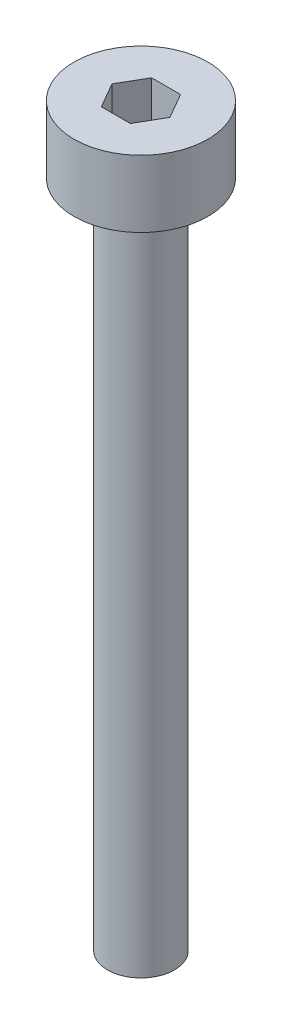
ISO-10303-21;
HEADER;
FILE_DESCRIPTION(('STEP AP214'),'2;1');
FILE_NAME('part.step','',(''),(''),'','','');
FILE_SCHEMA(('AUTOMOTIVE_DESIGN { 1 0 10303 214 1 1 1 1 }'));
ENDSEC;
DATA;
#1=APPLICATION_CONTEXT('core data for automotive mechanical design processes');
#2=APPLICATION_PROTOCOL_DEFINITION('international standard','automotive_design',2000,#1);
#3=PRODUCT_CONTEXT('',#1,'mechanical');
#4=PRODUCT('Part','Part','',(#3));
#5=PRODUCT_RELATED_PRODUCT_CATEGORY('part','',(#4));
#6=PRODUCT_DEFINITION_FORMATION('','',#4);
#7=PRODUCT_DEFINITION_CONTEXT('part definition',#1,'design');
#8=PRODUCT_DEFINITION('design','',#6,#7);
#9=PRODUCT_DEFINITION_SHAPE('','',#8);
#10=(LENGTH_UNIT() NAMED_UNIT(*) SI_UNIT(.MILLI.,.METRE.));
#11=(NAMED_UNIT(*) PLANE_ANGLE_UNIT() SI_UNIT($,.RADIAN.));
#12=(NAMED_UNIT(*) SI_UNIT($,.STERADIAN.) SOLID_ANGLE_UNIT());
#13=UNCERTAINTY_MEASURE_WITH_UNIT(LENGTH_MEASURE(1.E-05),#10,'distance_accuracy_value','');
#14=(GEOMETRIC_REPRESENTATION_CONTEXT(3) GLOBAL_UNCERTAINTY_ASSIGNED_CONTEXT((#13)) GLOBAL_UNIT_ASSIGNED_CONTEXT((#10,
#11,#12)) REPRESENTATION_CONTEXT('',''));
#15=CARTESIAN_POINT('',(0.,0.,0.));
#16=DIRECTION('',(0.,0.,1.));
#17=DIRECTION('',(1.,0.,0.));
#18=AXIS2_PLACEMENT_3D('',#15,#16,#17);
#19=CARTESIAN_POINT('',(0.,2.,0.));
#20=DIRECTION('',(0.,-1.,0.));
#21=DIRECTION('',(0.,0.,-1.));
#22=AXIS2_PLACEMENT_3D('',#19,#20,#21);
#23=CYLINDRICAL_SURFACE('',#22,2.);
#24=CARTESIAN_POINT('',(0.,2.,0.));
#25=DIRECTION('',(0.,1.,0.));
#26=DIRECTION('',(0.,0.,1.));
#27=AXIS2_PLACEMENT_3D('',#24,#25,#26);
#28=CIRCLE('',#27,2.);
#29=CARTESIAN_POINT('',(0.,2.,2.));
#30=VERTEX_POINT('',#29);
#31=EDGE_CURVE('E43',#30,#30,#28,.T.);
#32=ORIENTED_EDGE('',*,*,#31,.F.);
#33=EDGE_LOOP('',(#32));
#34=FACE_BOUND('',#33,.T.);
#35=CARTESIAN_POINT('',(0.,0.,0.));
#36=DIRECTION('',(0.,1.,0.));
#37=DIRECTION('',(0.,0.,1.));
#38=AXIS2_PLACEMENT_3D('',#35,#36,#37);
#39=CIRCLE('',#38,2.);
#40=CARTESIAN_POINT('',(0.,0.,2.));
#41=VERTEX_POINT('',#40);
#42=EDGE_CURVE('E38',#41,#41,#39,.T.);
#43=ORIENTED_EDGE('',*,*,#42,.T.);
#44=EDGE_LOOP('',(#43));
#45=FACE_BOUND('',#44,.T.);
#46=ADVANCED_FACE('F35',(#34,#45),#23,.T.);
#47=CARTESIAN_POINT('',(0.,2.,0.));
#48=DIRECTION('',(0.,1.,0.));
#49=DIRECTION('',(0.,0.,1.));
#50=AXIS2_PLACEMENT_3D('',#47,#48,#49);
#51=PLANE('',#50);
#52=DIRECTION('',(0.5,0.,-0.866025403784439));
#53=VECTOR('',#52,1.);
#54=CARTESIAN_POINT('',(0.433012701892219,2.,0.75));
#55=LINE('',#54,#53);
#56=CARTESIAN_POINT('',(0.433012701892219,2.,0.75));
#57=VERTEX_POINT('',#56);
#58=CARTESIAN_POINT('',(0.866025403784438,2.,0.));
#59=VERTEX_POINT('',#58);
#60=EDGE_CURVE('E51',#57,#59,#55,.T.);
#61=ORIENTED_EDGE('',*,*,#60,.F.);
#62=DIRECTION('',(1.,0.,0.));
#63=VECTOR('',#62,1.);
#64=CARTESIAN_POINT('',(-0.43301270189222,2.,0.75));
#65=LINE('',#64,#63);
#66=CARTESIAN_POINT('',(-0.43301270189222,2.,0.75));
#67=VERTEX_POINT('',#66);
#68=EDGE_CURVE('E135',#67,#57,#65,.T.);
#69=ORIENTED_EDGE('',*,*,#68,.F.);
#70=DIRECTION('',(0.5,0.,0.866025403784439));
#71=VECTOR('',#70,1.);
#72=CARTESIAN_POINT('',(-0.866025403784439,2.,0.));
#73=LINE('',#72,#71);
#74=CARTESIAN_POINT('',(-0.866025403784439,2.,0.));
#75=VERTEX_POINT('',#74);
#76=EDGE_CURVE('E133',#75,#67,#73,.T.);
#77=ORIENTED_EDGE('',*,*,#76,.F.);
#78=DIRECTION('',(-0.5,0.,0.866025403784439));
#79=VECTOR('',#78,1.);
#80=CARTESIAN_POINT('',(-0.43301270189222,2.,-0.750000000000001));
#81=LINE('',#80,#79);
#82=CARTESIAN_POINT('',(-0.43301270189222,2.,-0.750000000000001));
#83=VERTEX_POINT('',#82);
#84=EDGE_CURVE('E99',#83,#75,#81,.T.);
#85=ORIENTED_EDGE('',*,*,#84,.F.);
#86=DIRECTION('',(-1.,0.,0.));
#87=VECTOR('',#86,1.);
#88=CARTESIAN_POINT('',(0.433012701892219,2.,-0.75));
#89=LINE('',#88,#87);
#90=CARTESIAN_POINT('',(0.433012701892219,2.,-0.75));
#91=VERTEX_POINT('',#90);
#92=EDGE_CURVE('E129',#91,#83,#89,.T.);
#93=ORIENTED_EDGE('',*,*,#92,.F.);
#94=DIRECTION('',(-0.5,0.,-0.866025403784439));
#95=VECTOR('',#94,1.);
#96=CARTESIAN_POINT('',(0.866025403784438,2.,0.));
#97=LINE('',#96,#95);
#98=EDGE_CURVE('E125',#59,#91,#97,.T.);
#99=ORIENTED_EDGE('',*,*,#98,.F.);
#100=EDGE_LOOP('',(#61,#69,#77,#85,#93,#99));
#101=FACE_BOUND('',#100,.T.);
#102=ORIENTED_EDGE('',*,*,#31,.T.);
#103=EDGE_LOOP('',(#102));
#104=FACE_BOUND('',#103,.T.);
#105=ADVANCED_FACE('F153',(#101,#104),#51,.T.);
#106=CARTESIAN_POINT('',(0.,0.,0.));
#107=DIRECTION('',(0.,1.,0.));
#108=DIRECTION('',(0.,0.,1.));
#109=AXIS2_PLACEMENT_3D('',#106,#107,#108);
#110=PLANE('',#109);
#111=CARTESIAN_POINT('',(0.,0.,0.));
#112=DIRECTION('',(0.,-1.,0.));
#113=DIRECTION('',(0.,0.,-1.));
#114=AXIS2_PLACEMENT_3D('',#111,#112,#113);
#115=CIRCLE('',#114,1.);
#116=CARTESIAN_POINT('',(0.,0.,-1.));
#117=VERTEX_POINT('',#116);
#118=EDGE_CURVE('E11',#117,#117,#115,.T.);
#119=ORIENTED_EDGE('',*,*,#118,.F.);
#120=EDGE_LOOP('',(#119));
#121=FACE_BOUND('',#120,.T.);
#122=ORIENTED_EDGE('',*,*,#42,.F.);
#123=EDGE_LOOP('',(#122));
#124=FACE_BOUND('',#123,.T.);
#125=ADVANCED_FACE('F150',(#121,#124),#110,.F.);
#126=CARTESIAN_POINT('',(0.433012701892219,0.5,0.75));
#127=DIRECTION('',(0.866025403784439,0.,0.5));
#128=DIRECTION('',(0.5,0.,-0.866025403784439));
#129=AXIS2_PLACEMENT_3D('',#126,#127,#128);
#130=PLANE('',#129);
#131=ORIENTED_EDGE('',*,*,#60,.T.);
#132=DIRECTION('',(0.,1.,0.));
#133=VECTOR('',#132,1.);
#134=CARTESIAN_POINT('',(0.866025403784438,0.5,0.));
#135=LINE('',#134,#133);
#136=CARTESIAN_POINT('',(0.866025403784438,0.5,0.));
#137=VERTEX_POINT('',#136);
#138=EDGE_CURVE('E81',#137,#59,#135,.T.);
#139=ORIENTED_EDGE('',*,*,#138,.F.);
#140=DIRECTION('',(0.5,0.,-0.866025403784439));
#141=VECTOR('',#140,1.);
#142=CARTESIAN_POINT('',(0.433012701892219,0.5,0.75));
#143=LINE('',#142,#141);
#144=CARTESIAN_POINT('',(0.433012701892219,0.5,0.75));
#145=VERTEX_POINT('',#144);
#146=EDGE_CURVE('E137',#145,#137,#143,.T.);
#147=ORIENTED_EDGE('',*,*,#146,.F.);
#148=DIRECTION('',(0.,1.,0.));
#149=VECTOR('',#148,1.);
#150=CARTESIAN_POINT('',(0.433012701892219,0.5,0.75));
#151=LINE('',#150,#149);
#152=EDGE_CURVE('E59',#145,#57,#151,.T.);
#153=ORIENTED_EDGE('',*,*,#152,.T.);
#154=EDGE_LOOP('',(#131,#139,#147,#153));
#155=FACE_BOUND('',#154,.T.);
#156=ADVANCED_FACE('F152',(#155),#130,.F.);
#157=CARTESIAN_POINT('',(-0.43301270189222,0.5,0.75));
#158=DIRECTION('',(0.,0.,1.));
#159=DIRECTION('',(1.,0.,0.));
#160=AXIS2_PLACEMENT_3D('',#157,#158,#159);
#161=PLANE('',#160);
#162=ORIENTED_EDGE('',*,*,#68,.T.);
#163=ORIENTED_EDGE('',*,*,#152,.F.);
#164=DIRECTION('',(1.,0.,0.));
#165=VECTOR('',#164,1.);
#166=CARTESIAN_POINT('',(-0.43301270189222,0.5,0.75));
#167=LINE('',#166,#165);
#168=CARTESIAN_POINT('',(-0.43301270189222,0.5,0.75));
#169=VERTEX_POINT('',#168);
#170=EDGE_CURVE('E111',#169,#145,#167,.T.);
#171=ORIENTED_EDGE('',*,*,#170,.F.);
#172=DIRECTION('',(0.,1.,0.));
#173=VECTOR('',#172,1.);
#174=CARTESIAN_POINT('',(-0.43301270189222,0.5,0.75));
#175=LINE('',#174,#173);
#176=EDGE_CURVE('E103',#169,#67,#175,.T.);
#177=ORIENTED_EDGE('',*,*,#176,.T.);
#178=EDGE_LOOP('',(#162,#163,#171,#177));
#179=FACE_BOUND('',#178,.T.);
#180=ADVANCED_FACE('F159',(#179),#161,.F.);
#181=CARTESIAN_POINT('',(-0.866025403784439,0.5,0.));
#182=DIRECTION('',(-0.866025403784439,0.,0.5));
#183=DIRECTION('',(0.5,0.,0.866025403784439));
#184=AXIS2_PLACEMENT_3D('',#181,#182,#183);
#185=PLANE('',#184);
#186=ORIENTED_EDGE('',*,*,#76,.T.);
#187=ORIENTED_EDGE('',*,*,#176,.F.);
#188=DIRECTION('',(0.5,0.,0.866025403784439));
#189=VECTOR('',#188,1.);
#190=CARTESIAN_POINT('',(-0.866025403784439,0.5,0.));
#191=LINE('',#190,#189);
#192=CARTESIAN_POINT('',(-0.866025403784439,0.5,0.));
#193=VERTEX_POINT('',#192);
#194=EDGE_CURVE('E107',#193,#169,#191,.T.);
#195=ORIENTED_EDGE('',*,*,#194,.F.);
#196=DIRECTION('',(0.,1.,0.));
#197=VECTOR('',#196,1.);
#198=CARTESIAN_POINT('',(-0.866025403784439,0.5,0.));
#199=LINE('',#198,#197);
#200=EDGE_CURVE('E92',#193,#75,#199,.T.);
#201=ORIENTED_EDGE('',*,*,#200,.T.);
#202=EDGE_LOOP('',(#186,#187,#195,#201));
#203=FACE_BOUND('',#202,.T.);
#204=ADVANCED_FACE('F108',(#203),#185,.F.);
#205=CARTESIAN_POINT('',(-0.43301270189222,0.5,-0.750000000000001));
#206=DIRECTION('',(-0.866025403784439,0.,-0.5));
#207=DIRECTION('',(-0.5,0.,0.866025403784439));
#208=AXIS2_PLACEMENT_3D('',#205,#206,#207);
#209=PLANE('',#208);
#210=ORIENTED_EDGE('',*,*,#84,.T.);
#211=ORIENTED_EDGE('',*,*,#200,.F.);
#212=DIRECTION('',(-0.5,0.,0.866025403784439));
#213=VECTOR('',#212,1.);
#214=CARTESIAN_POINT('',(-0.43301270189222,0.5,-0.750000000000001));
#215=LINE('',#214,#213);
#216=CARTESIAN_POINT('',(-0.43301270189222,0.5,-0.750000000000001));
#217=VERTEX_POINT('',#216);
#218=EDGE_CURVE('E96',#217,#193,#215,.T.);
#219=ORIENTED_EDGE('',*,*,#218,.F.);
#220=DIRECTION('',(0.,1.,0.));
#221=VECTOR('',#220,1.);
#222=CARTESIAN_POINT('',(-0.43301270189222,0.5,-0.750000000000001));
#223=LINE('',#222,#221);
#224=EDGE_CURVE('E104',#217,#83,#223,.T.);
#225=ORIENTED_EDGE('',*,*,#224,.T.);
#226=EDGE_LOOP('',(#210,#211,#219,#225));
#227=FACE_BOUND('',#226,.T.);
#228=ADVANCED_FACE('F94',(#227),#209,.F.);
#229=CARTESIAN_POINT('',(0.433012701892219,0.5,-0.75));
#230=DIRECTION('',(0.,0.,-1.));
#231=DIRECTION('',(-1.,0.,0.));
#232=AXIS2_PLACEMENT_3D('',#229,#230,#231);
#233=PLANE('',#232);
#234=ORIENTED_EDGE('',*,*,#92,.T.);
#235=ORIENTED_EDGE('',*,*,#224,.F.);
#236=DIRECTION('',(-1.,0.,0.));
#237=VECTOR('',#236,1.);
#238=CARTESIAN_POINT('',(0.433012701892219,0.5,-0.75));
#239=LINE('',#238,#237);
#240=CARTESIAN_POINT('',(0.433012701892219,0.5,-0.75));
#241=VERTEX_POINT('',#240);
#242=EDGE_CURVE('E117',#241,#217,#239,.T.);
#243=ORIENTED_EDGE('',*,*,#242,.F.);
#244=DIRECTION('',(0.,1.,0.));
#245=VECTOR('',#244,1.);
#246=CARTESIAN_POINT('',(0.433012701892219,0.5,-0.75));
#247=LINE('',#246,#245);
#248=EDGE_CURVE('E141',#241,#91,#247,.T.);
#249=ORIENTED_EDGE('',*,*,#248,.T.);
#250=EDGE_LOOP('',(#234,#235,#243,#249));
#251=FACE_BOUND('',#250,.T.);
#252=ADVANCED_FACE('F204',(#251),#233,.F.);
#253=CARTESIAN_POINT('',(0.866025403784438,0.5,0.));
#254=DIRECTION('',(0.866025403784438,0.,-0.5));
#255=DIRECTION('',(-0.5,0.,-0.866025403784439));
#256=AXIS2_PLACEMENT_3D('',#253,#254,#255);
#257=PLANE('',#256);
#258=ORIENTED_EDGE('',*,*,#98,.T.);
#259=ORIENTED_EDGE('',*,*,#248,.F.);
#260=DIRECTION('',(-0.5,0.,-0.866025403784439));
#261=VECTOR('',#260,1.);
#262=CARTESIAN_POINT('',(0.866025403784438,0.5,0.));
#263=LINE('',#262,#261);
#264=EDGE_CURVE('E119',#137,#241,#263,.T.);
#265=ORIENTED_EDGE('',*,*,#264,.F.);
#266=ORIENTED_EDGE('',*,*,#138,.T.);
#267=EDGE_LOOP('',(#258,#259,#265,#266));
#268=FACE_BOUND('',#267,.T.);
#269=ADVANCED_FACE('F213',(#268),#257,.F.);
#270=CARTESIAN_POINT('',(0.,0.5,0.));
#271=DIRECTION('',(0.,1.,0.));
#272=DIRECTION('',(0.,0.,1.));
#273=AXIS2_PLACEMENT_3D('',#270,#271,#272);
#274=PLANE('',#273);
#275=ORIENTED_EDGE('',*,*,#146,.T.);
#276=ORIENTED_EDGE('',*,*,#264,.T.);
#277=ORIENTED_EDGE('',*,*,#242,.T.);
#278=ORIENTED_EDGE('',*,*,#218,.T.);
#279=ORIENTED_EDGE('',*,*,#194,.T.);
#280=ORIENTED_EDGE('',*,*,#170,.T.);
#281=EDGE_LOOP('',(#275,#276,#277,#278,#279,#280));
#282=FACE_BOUND('',#281,.T.);
#283=ADVANCED_FACE('F114',(#282),#274,.T.);
#284=CARTESIAN_POINT('',(0.,-20.,0.));
#285=DIRECTION('',(0.,1.,0.));
#286=DIRECTION('',(0.,0.,1.));
#287=AXIS2_PLACEMENT_3D('',#284,#285,#286);
#288=CYLINDRICAL_SURFACE('',#287,1.);
#289=CARTESIAN_POINT('',(0.,-20.,0.));
#290=DIRECTION('',(0.,-1.,0.));
#291=DIRECTION('',(0.,0.,-1.));
#292=AXIS2_PLACEMENT_3D('',#289,#290,#291);
#293=CIRCLE('',#292,1.);
#294=CARTESIAN_POINT('',(0.,-20.,-1.));
#295=VERTEX_POINT('',#294);
#296=EDGE_CURVE('E126',#295,#295,#293,.T.);
#297=ORIENTED_EDGE('',*,*,#296,.F.);
#298=EDGE_LOOP('',(#297));
#299=FACE_BOUND('',#298,.T.);
#300=ORIENTED_EDGE('',*,*,#118,.T.);
#301=EDGE_LOOP('',(#300));
#302=FACE_BOUND('',#301,.T.);
#303=ADVANCED_FACE('F231',(#299,#302),#288,.T.);
#304=CARTESIAN_POINT('',(0.,-20.,0.));
#305=DIRECTION('',(0.,-1.,0.));
#306=DIRECTION('',(0.,0.,-1.));
#307=AXIS2_PLACEMENT_3D('',#304,#305,#306);
#308=PLANE('',#307);
#309=ORIENTED_EDGE('',*,*,#296,.T.);
#310=EDGE_LOOP('',(#309));
#311=FACE_BOUND('',#310,.T.);
#312=ADVANCED_FACE('F244',(#311),#308,.T.);
#313=CLOSED_SHELL('',(#46,#105,#125,#156,#180,#204,#228,#252,#269,#283,#303,#312));
#314=MANIFOLD_SOLID_BREP('B2',#313);
#315=ADVANCED_BREP_SHAPE_REPRESENTATION('',(#18,#314),#14);
#316=SHAPE_DEFINITION_REPRESENTATION(#9,#315);
ENDSEC;
END-ISO-10303-21;
